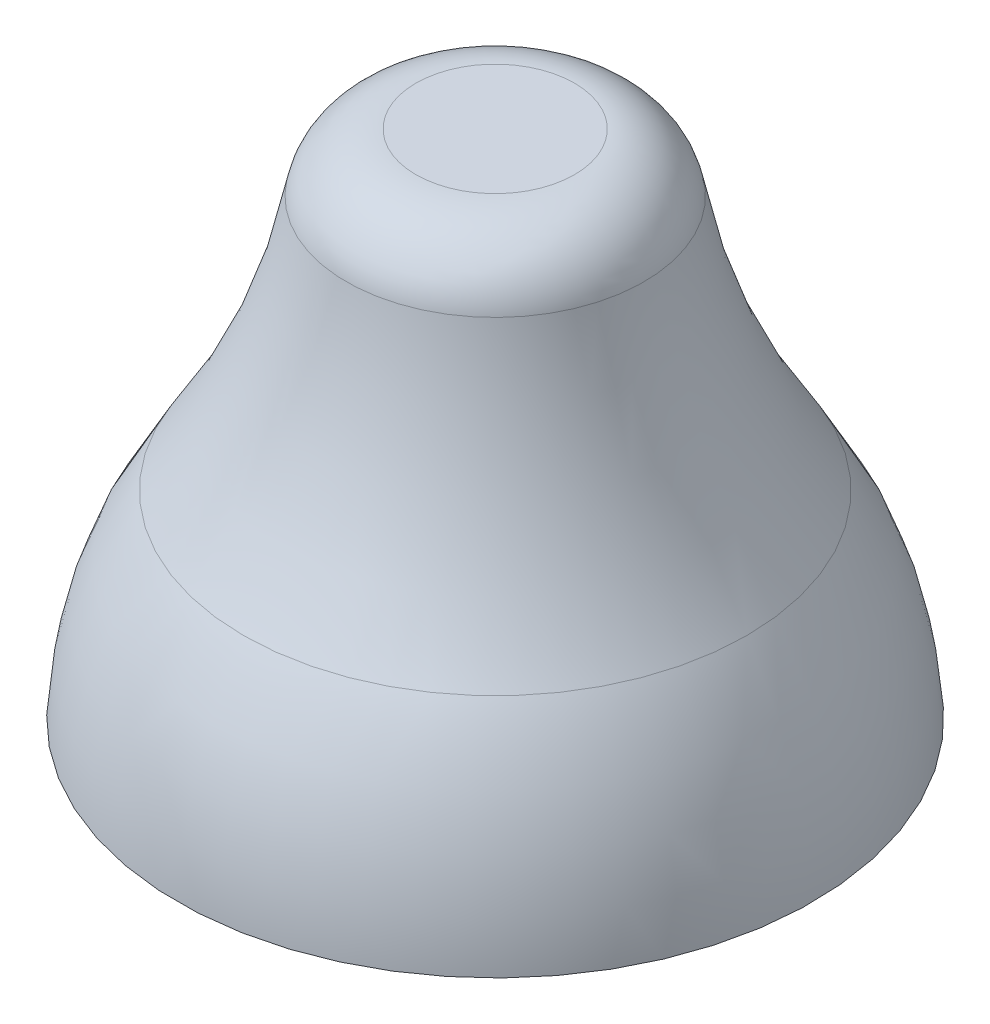
ISO-10303-21;
HEADER;
FILE_DESCRIPTION(('STEP AP214'),'2;1');
FILE_NAME('part.step','',(''),(''),'','','');
FILE_SCHEMA(('AUTOMOTIVE_DESIGN { 1 0 10303 214 1 1 1 1 }'));
ENDSEC;
DATA;
#1=APPLICATION_CONTEXT('core data for automotive mechanical design processes');
#2=APPLICATION_PROTOCOL_DEFINITION('international standard','automotive_design',2000,#1);
#3=PRODUCT_CONTEXT('',#1,'mechanical');
#4=PRODUCT('Part','Part','',(#3));
#5=PRODUCT_RELATED_PRODUCT_CATEGORY('part','',(#4));
#6=PRODUCT_DEFINITION_FORMATION('','',#4);
#7=PRODUCT_DEFINITION_CONTEXT('part definition',#1,'design');
#8=PRODUCT_DEFINITION('design','',#6,#7);
#9=PRODUCT_DEFINITION_SHAPE('','',#8);
#10=(LENGTH_UNIT() NAMED_UNIT(*) SI_UNIT(.MILLI.,.METRE.));
#11=(NAMED_UNIT(*) PLANE_ANGLE_UNIT() SI_UNIT($,.RADIAN.));
#12=(NAMED_UNIT(*) SI_UNIT($,.STERADIAN.) SOLID_ANGLE_UNIT());
#13=UNCERTAINTY_MEASURE_WITH_UNIT(LENGTH_MEASURE(1.E-05),#10,'distance_accuracy_value','');
#14=(GEOMETRIC_REPRESENTATION_CONTEXT(3) GLOBAL_UNCERTAINTY_ASSIGNED_CONTEXT((#13)) GLOBAL_UNIT_ASSIGNED_CONTEXT((#10,
#11,#12)) REPRESENTATION_CONTEXT('',''));
#15=CARTESIAN_POINT('',(0.,0.,0.));
#16=DIRECTION('',(0.,0.,1.));
#17=DIRECTION('',(1.,0.,0.));
#18=AXIS2_PLACEMENT_3D('',#15,#16,#17);
#19=CARTESIAN_POINT('',(0.,1.45,0.));
#20=DIRECTION('',(0.,1.,0.));
#21=DIRECTION('',(0.,0.,1.));
#22=AXIS2_PLACEMENT_3D('',#19,#20,#21);
#23=PLANE('',#22);
#24=CARTESIAN_POINT('',(0.,1.45,0.));
#25=DIRECTION('',(0.,-1.,0.));
#26=DIRECTION('',(0.,0.,-1.));
#27=AXIS2_PLACEMENT_3D('',#24,#25,#26);
#28=CIRCLE('',#27,0.225);
#29=CARTESIAN_POINT('',(0.,1.45,-0.225));
#30=VERTEX_POINT('',#29);
#31=CARTESIAN_POINT('',(0.,1.45,0.225));
#32=VERTEX_POINT('',#31);
#33=EDGE_CURVE('E36',#30,#32,#28,.T.);
#34=ORIENTED_EDGE('',*,*,#33,.F.);
#35=CARTESIAN_POINT('',(0.,1.45,0.));
#36=DIRECTION('',(0.,-1.,0.));
#37=DIRECTION('',(0.,0.,1.));
#38=AXIS2_PLACEMENT_3D('',#35,#36,#37);
#39=CIRCLE('',#38,0.225);
#40=EDGE_CURVE('E33',#32,#30,#39,.T.);
#41=ORIENTED_EDGE('',*,*,#40,.F.);
#42=EDGE_LOOP('',(#34,#41));
#43=FACE_BOUND('',#42,.T.);
#44=ADVANCED_FACE('F17',(#43),#23,.T.);
#45=CARTESIAN_POINT('',(0.,0.5,0.));
#46=DIRECTION('',(0.,-1.,0.));
#47=DIRECTION('',(0.,0.,-1.));
#48=AXIS2_PLACEMENT_3D('',#45,#46,#47);
#49=PLANE('',#48);
#50=CARTESIAN_POINT('',(0.,0.5,0.));
#51=DIRECTION('',(0.,-1.,0.));
#52=DIRECTION('',(0.,0.,-1.));
#53=AXIS2_PLACEMENT_3D('',#50,#51,#52);
#54=CIRCLE('',#53,0.5);
#55=CARTESIAN_POINT('',(0.,0.5,-0.5));
#56=VERTEX_POINT('',#55);
#57=EDGE_CURVE('E21',#56,#56,#54,.T.);
#58=ORIENTED_EDGE('',*,*,#57,.T.);
#59=EDGE_LOOP('',(#58));
#60=FACE_BOUND('',#59,.T.);
#61=ADVANCED_FACE('F58',(#60),#49,.T.);
#62=CARTESIAN_POINT('',(0.,1.25,0.));
#63=DIRECTION('',(0.,-1.,0.));
#64=DIRECTION('',(0.,0.,-1.));
#65=AXIS2_PLACEMENT_3D('',#62,#63,#64);
#66=TOROIDAL_SURFACE('',#65,0.225,0.2);
#67=ORIENTED_EDGE('',*,*,#33,.T.);
#68=ORIENTED_EDGE('',*,*,#40,.T.);
#69=EDGE_LOOP('',(#67,#68));
#70=FACE_BOUND('',#69,.T.);
#71=CARTESIAN_POINT('',(0.,1.285,0.));
#72=DIRECTION('',(0.,-1.,0.));
#73=DIRECTION('',(0.,0.,-1.));
#74=AXIS2_PLACEMENT_3D('',#71,#72,#73);
#75=CIRCLE('',#74,0.421913686675155);
#76=CARTESIAN_POINT('',(0.,1.285,-0.421913686675155));
#77=VERTEX_POINT('',#76);
#78=EDGE_CURVE('E75',#77,#77,#75,.F.);
#79=ORIENTED_EDGE('',*,*,#78,.T.);
#80=EDGE_LOOP('',(#79));
#81=FACE_BOUND('',#80,.T.);
#82=ADVANCED_FACE('F38',(#70,#81),#66,.T.);
#83=CARTESIAN_POINT('',(0.,0.5,0.));
#84=DIRECTION('',(0.,-1.,0.));
#85=DIRECTION('',(0.,0.,-1.));
#86=AXIS2_PLACEMENT_3D('',#83,#84,#85);
#87=CYLINDRICAL_SURFACE('',#86,0.5);
#88=CARTESIAN_POINT('',(0.,0.,0.));
#89=DIRECTION('',(0.,-1.,0.));
#90=DIRECTION('',(0.,0.,-1.));
#91=AXIS2_PLACEMENT_3D('',#88,#89,#90);
#92=CIRCLE('',#91,0.5);
#93=CARTESIAN_POINT('',(0.,0.,-0.5));
#94=VERTEX_POINT('',#93);
#95=EDGE_CURVE('E78',#94,#94,#92,.F.);
#96=ORIENTED_EDGE('',*,*,#95,.F.);
#97=EDGE_LOOP('',(#96));
#98=FACE_BOUND('',#97,.T.);
#99=ORIENTED_EDGE('',*,*,#57,.F.);
#100=EDGE_LOOP('',(#99));
#101=FACE_BOUND('',#100,.T.);
#102=ADVANCED_FACE('F67',(#98,#101),#87,.F.);
#103=CARTESIAN_POINT('',(0.,1.62005549957691,0.));
#104=DIRECTION('',(0.,-1.,0.));
#105=DIRECTION('',(0.,0.,-1.));
#106=AXIS2_PLACEMENT_3D('',#103,#104,#105);
#107=TOROIDAL_SURFACE('',#106,2.29213768721714,1.9);
#108=ORIENTED_EDGE('',*,*,#78,.F.);
#109=EDGE_LOOP('',(#108));
#110=FACE_BOUND('',#109,.T.);
#111=CARTESIAN_POINT('',(0.,0.562,0.));
#112=DIRECTION('',(0.,1.,0.));
#113=DIRECTION('',(0.,0.,1.));
#114=AXIS2_PLACEMENT_3D('',#111,#112,#113);
#115=CIRCLE('',#114,0.714);
#116=CARTESIAN_POINT('',(0.,0.562,0.714));
#117=VERTEX_POINT('',#116);
#118=EDGE_CURVE('E27',#117,#117,#115,.T.);
#119=ORIENTED_EDGE('',*,*,#118,.T.);
#120=EDGE_LOOP('',(#119));
#121=FACE_BOUND('',#120,.T.);
#122=ADVANCED_FACE('F83',(#110,#121),#107,.F.);
#123=CARTESIAN_POINT('',(0.,0.,0.));
#124=DIRECTION('',(0.,-1.,0.));
#125=DIRECTION('',(0.,0.,-1.));
#126=AXIS2_PLACEMENT_3D('',#123,#124,#125);
#127=PLANE('',#126);
#128=ORIENTED_EDGE('',*,*,#95,.T.);
#129=EDGE_LOOP('',(#128));
#130=FACE_BOUND('',#129,.T.);
#131=CARTESIAN_POINT('',(0.,0.,0.));
#132=DIRECTION('',(0.,-1.,0.));
#133=DIRECTION('',(0.,0.,-1.));
#134=AXIS2_PLACEMENT_3D('',#131,#132,#133);
#135=CIRCLE('',#134,0.9);
#136=CARTESIAN_POINT('',(0.,0.,-0.9));
#137=VERTEX_POINT('',#136);
#138=EDGE_CURVE('E11',#137,#137,#135,.T.);
#139=ORIENTED_EDGE('',*,*,#138,.T.);
#140=EDGE_LOOP('',(#139));
#141=FACE_BOUND('',#140,.T.);
#142=ADVANCED_FACE('F86',(#130,#141),#127,.T.);
#143=CARTESIAN_POINT('',(0.,-0.0518725651329581,0.));
#144=DIRECTION('',(0.,-1.,0.));
#145=DIRECTION('',(0.,0.,-1.));
#146=AXIS2_PLACEMENT_3D('',#143,#144,#145);
#147=DEGENERATE_TOROIDAL_SURFACE('',#146,0.198776245186679,1.1,.F.);
#148=ORIENTED_EDGE('',*,*,#118,.F.);
#149=EDGE_LOOP('',(#148));
#150=FACE_BOUND('',#149,.T.);
#151=ORIENTED_EDGE('',*,*,#138,.F.);
#152=EDGE_LOOP('',(#151));
#153=FACE_BOUND('',#152,.T.);
#154=ADVANCED_FACE('F19',(#150,#153),#147,.F.);
#155=CLOSED_SHELL('',(#44,#61,#82,#102,#122,#142,#154));
#156=MANIFOLD_SOLID_BREP('B1',#155);
#157=ADVANCED_BREP_SHAPE_REPRESENTATION('',(#18,#156),#14);
#158=SHAPE_DEFINITION_REPRESENTATION(#9,#157);
ENDSEC;
END-ISO-10303-21;
